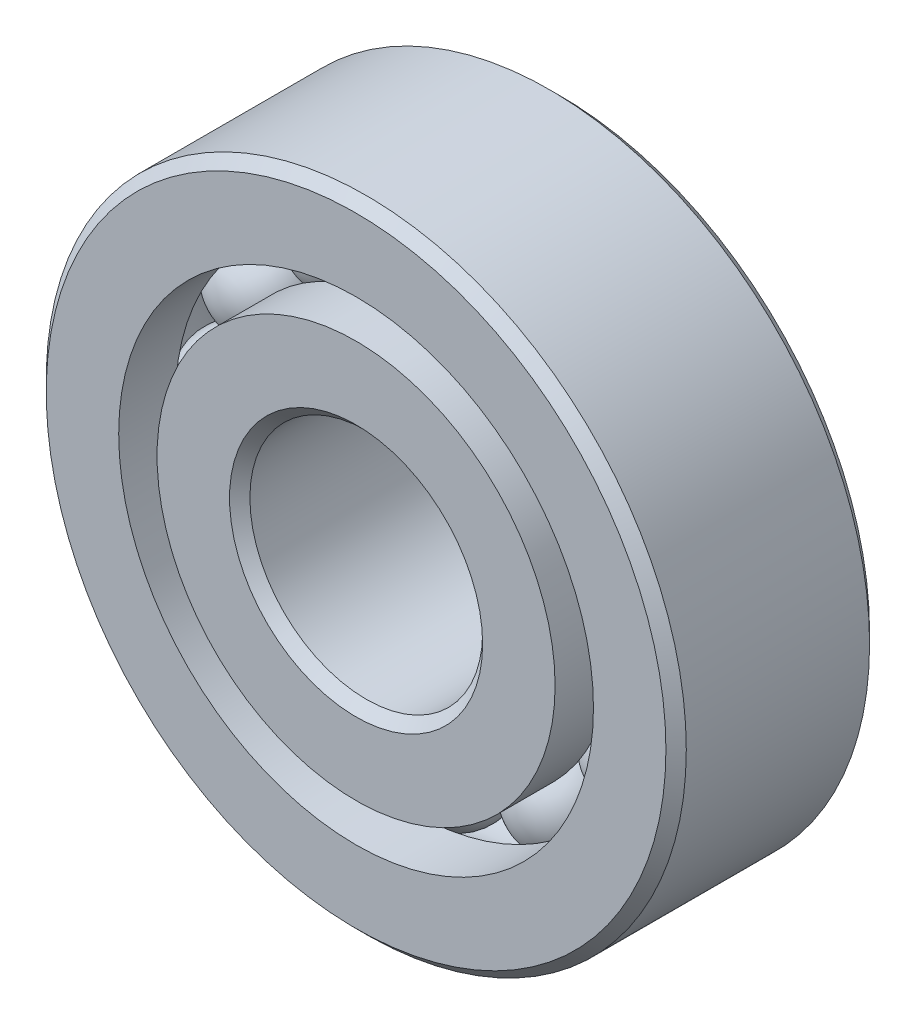
ISO-10303-21;
HEADER;
FILE_DESCRIPTION(('STEP AP214'),'2;1');
FILE_NAME('part.step','',(''),(''),'','','');
FILE_SCHEMA(('AUTOMOTIVE_DESIGN { 1 0 10303 214 1 1 1 1 }'));
ENDSEC;
DATA;
#1=APPLICATION_CONTEXT('core data for automotive mechanical design processes');
#2=APPLICATION_PROTOCOL_DEFINITION('international standard','automotive_design',2000,#1);
#3=PRODUCT_CONTEXT('',#1,'mechanical');
#4=PRODUCT('Part','Part','',(#3));
#5=PRODUCT_RELATED_PRODUCT_CATEGORY('part','',(#4));
#6=PRODUCT_DEFINITION_FORMATION('','',#4);
#7=PRODUCT_DEFINITION_CONTEXT('part definition',#1,'design');
#8=PRODUCT_DEFINITION('design','',#6,#7);
#9=PRODUCT_DEFINITION_SHAPE('','',#8);
#10=(LENGTH_UNIT() NAMED_UNIT(*) SI_UNIT(.MILLI.,.METRE.));
#11=(NAMED_UNIT(*) PLANE_ANGLE_UNIT() SI_UNIT($,.RADIAN.));
#12=(NAMED_UNIT(*) SI_UNIT($,.STERADIAN.) SOLID_ANGLE_UNIT());
#13=UNCERTAINTY_MEASURE_WITH_UNIT(LENGTH_MEASURE(1.E-05),#10,'distance_accuracy_value','');
#14=(GEOMETRIC_REPRESENTATION_CONTEXT(3) GLOBAL_UNCERTAINTY_ASSIGNED_CONTEXT((#13)) GLOBAL_UNIT_ASSIGNED_CONTEXT((#10,
#11,#12)) REPRESENTATION_CONTEXT('',''));
#15=CARTESIAN_POINT('',(0.,0.,0.));
#16=DIRECTION('',(0.,0.,1.));
#17=DIRECTION('',(1.,0.,0.));
#18=AXIS2_PLACEMENT_3D('',#15,#16,#17);
#19=CARTESIAN_POINT('',(-3.74999999999992,6.49519052838334,0.));
#20=DIRECTION('',(0.,0.,1.));
#21=DIRECTION('',(-0.499999999999989,0.866025403784445,0.));
#22=AXIS2_PLACEMENT_3D('',#19,#20,#21);
#23=SPHERICAL_SURFACE('',#22,1.68952158656808);
#24=CARTESIAN_POINT('',(-3.74999999999992,6.49519052838334,1.68952158656808));
#25=VERTEX_POINT('',#24);
#26=VERTEX_LOOP('',#25);
#27=FACE_BOUND('',#26,.T.);
#28=ADVANCED_FACE('F39',(#27),#23,.T.);
#29=CLOSED_SHELL('',(#28));
#30=MANIFOLD_SOLID_BREP('B2',#29);
#31=CARTESIAN_POINT('',(-6.49519052838325,3.75000000000008,0.));
#32=DIRECTION('',(0.,0.,1.));
#33=DIRECTION('',(-0.866025403784433,0.50000000000001,0.));
#34=AXIS2_PLACEMENT_3D('',#31,#32,#33);
#35=SPHERICAL_SURFACE('',#34,1.68952158656808);
#36=CARTESIAN_POINT('',(-6.49519052838325,3.75000000000008,1.68952158656808));
#37=VERTEX_POINT('',#36);
#38=VERTEX_LOOP('',#37);
#39=FACE_BOUND('',#38,.T.);
#40=ADVANCED_FACE('F59',(#39),#35,.T.);
#41=CLOSED_SHELL('',(#40));
#42=MANIFOLD_SOLID_BREP('B6',#41);
#43=CARTESIAN_POINT('',(-7.5,0.,0.));
#44=DIRECTION('',(0.,0.,1.));
#45=DIRECTION('',(-1.,0.,0.));
#46=AXIS2_PLACEMENT_3D('',#43,#44,#45);
#47=SPHERICAL_SURFACE('',#46,1.68952158656808);
#48=CARTESIAN_POINT('',(-7.5,0.,1.68952158656808));
#49=VERTEX_POINT('',#48);
#50=VERTEX_LOOP('',#49);
#51=FACE_BOUND('',#50,.T.);
#52=ADVANCED_FACE('F79',(#51),#47,.T.);
#53=CLOSED_SHELL('',(#52));
#54=MANIFOLD_SOLID_BREP('B35',#53);
#55=CARTESIAN_POINT('',(-6.49519052838332,-3.74999999999994,0.));
#56=DIRECTION('',(0.,0.,1.));
#57=DIRECTION('',(-0.866025403784443,-0.499999999999992,0.));
#58=AXIS2_PLACEMENT_3D('',#55,#56,#57);
#59=SPHERICAL_SURFACE('',#58,1.68952158656808);
#60=CARTESIAN_POINT('',(-6.49519052838332,-3.74999999999994,1.68952158656808));
#61=VERTEX_POINT('',#60);
#62=VERTEX_LOOP('',#61);
#63=FACE_BOUND('',#62,.T.);
#64=ADVANCED_FACE('F99',(#63),#59,.T.);
#65=CLOSED_SHELL('',(#64));
#66=MANIFOLD_SOLID_BREP('B55',#65);
#67=CARTESIAN_POINT('',(-3.75000000000005,-6.49519052838326,0.));
#68=DIRECTION('',(0.,0.,1.));
#69=DIRECTION('',(-0.500000000000007,-0.866025403784435,0.));
#70=AXIS2_PLACEMENT_3D('',#67,#68,#69);
#71=SPHERICAL_SURFACE('',#70,1.68952158656808);
#72=CARTESIAN_POINT('',(-3.75000000000005,-6.49519052838326,1.68952158656808));
#73=VERTEX_POINT('',#72);
#74=VERTEX_LOOP('',#73);
#75=FACE_BOUND('',#74,.T.);
#76=ADVANCED_FACE('F119',(#75),#71,.T.);
#77=CLOSED_SHELL('',(#76));
#78=MANIFOLD_SOLID_BREP('B75',#77);
#79=CARTESIAN_POINT('',(0.,-7.5,0.));
#80=DIRECTION('',(0.,0.,1.));
#81=DIRECTION('',(0.,-1.,0.));
#82=AXIS2_PLACEMENT_3D('',#79,#80,#81);
#83=SPHERICAL_SURFACE('',#82,1.68952158656808);
#84=CARTESIAN_POINT('',(0.,-7.5,1.68952158656808));
#85=VERTEX_POINT('',#84);
#86=VERTEX_LOOP('',#85);
#87=FACE_BOUND('',#86,.T.);
#88=ADVANCED_FACE('F139',(#87),#83,.T.);
#89=CLOSED_SHELL('',(#88));
#90=MANIFOLD_SOLID_BREP('B95',#89);
#91=CARTESIAN_POINT('',(3.74999999999996,-6.49519052838331,0.));
#92=DIRECTION('',(0.,0.,1.));
#93=DIRECTION('',(0.499999999999995,-0.866025403784442,0.));
#94=AXIS2_PLACEMENT_3D('',#91,#92,#93);
#95=SPHERICAL_SURFACE('',#94,1.68952158656808);
#96=CARTESIAN_POINT('',(3.74999999999996,-6.49519052838331,1.68952158656808));
#97=VERTEX_POINT('',#96);
#98=VERTEX_LOOP('',#97);
#99=FACE_BOUND('',#98,.T.);
#100=ADVANCED_FACE('F159',(#99),#95,.T.);
#101=CLOSED_SHELL('',(#100));
#102=MANIFOLD_SOLID_BREP('B115',#101);
#103=CARTESIAN_POINT('',(6.49519052838327,-3.75000000000003,0.));
#104=DIRECTION('',(0.,0.,1.));
#105=DIRECTION('',(0.866025403784436,-0.500000000000004,0.));
#106=AXIS2_PLACEMENT_3D('',#103,#104,#105);
#107=SPHERICAL_SURFACE('',#106,1.68952158656808);
#108=CARTESIAN_POINT('',(6.49519052838327,-3.75000000000003,1.68952158656808));
#109=VERTEX_POINT('',#108);
#110=VERTEX_LOOP('',#109);
#111=FACE_BOUND('',#110,.T.);
#112=ADVANCED_FACE('F179',(#111),#107,.T.);
#113=CLOSED_SHELL('',(#112));
#114=MANIFOLD_SOLID_BREP('B135',#113);
#115=CARTESIAN_POINT('',(7.5,0.,0.));
#116=DIRECTION('',(0.,0.,1.));
#117=DIRECTION('',(1.,0.,0.));
#118=AXIS2_PLACEMENT_3D('',#115,#116,#117);
#119=SPHERICAL_SURFACE('',#118,1.68952158656808);
#120=CARTESIAN_POINT('',(7.5,0.,1.68952158656808));
#121=VERTEX_POINT('',#120);
#122=VERTEX_LOOP('',#121);
#123=FACE_BOUND('',#122,.T.);
#124=ADVANCED_FACE('F199',(#123),#119,.T.);
#125=CLOSED_SHELL('',(#124));
#126=MANIFOLD_SOLID_BREP('B155',#125);
#127=CARTESIAN_POINT('',(6.4951905283833,3.74999999999998,0.));
#128=DIRECTION('',(0.,0.,1.));
#129=DIRECTION('',(0.86602540378444,0.499999999999998,0.));
#130=AXIS2_PLACEMENT_3D('',#127,#128,#129);
#131=SPHERICAL_SURFACE('',#130,1.68952158656808);
#132=CARTESIAN_POINT('',(6.4951905283833,3.74999999999998,1.68952158656808));
#133=VERTEX_POINT('',#132);
#134=VERTEX_LOOP('',#133);
#135=FACE_BOUND('',#134,.T.);
#136=ADVANCED_FACE('F219',(#135),#131,.T.);
#137=CLOSED_SHELL('',(#136));
#138=MANIFOLD_SOLID_BREP('B175',#137);
#139=CARTESIAN_POINT('',(3.75000000000001,6.49519052838328,0.));
#140=DIRECTION('',(0.,0.,1.));
#141=DIRECTION('',(0.500000000000001,0.866025403784438,0.));
#142=AXIS2_PLACEMENT_3D('',#139,#140,#141);
#143=SPHERICAL_SURFACE('',#142,1.68952158656808);
#144=CARTESIAN_POINT('',(3.75000000000001,6.49519052838328,1.68952158656808));
#145=VERTEX_POINT('',#144);
#146=VERTEX_LOOP('',#145);
#147=FACE_BOUND('',#146,.T.);
#148=ADVANCED_FACE('F239',(#147),#143,.T.);
#149=CLOSED_SHELL('',(#148));
#150=MANIFOLD_SOLID_BREP('B195',#149);
#151=CARTESIAN_POINT('',(0.,7.5,0.));
#152=DIRECTION('',(0.,0.,1.));
#153=DIRECTION('',(0.,1.,0.));
#154=AXIS2_PLACEMENT_3D('',#151,#152,#153);
#155=SPHERICAL_SURFACE('',#154,1.68952158656808);
#156=CARTESIAN_POINT('',(0.,7.5,1.68952158656808));
#157=VERTEX_POINT('',#156);
#158=VERTEX_LOOP('',#157);
#159=FACE_BOUND('',#158,.T.);
#160=ADVANCED_FACE('F261',(#159),#155,.T.);
#161=CLOSED_SHELL('',(#160));
#162=MANIFOLD_SOLID_BREP('B215',#161);
#163=CARTESIAN_POINT('',(0.,6.84065934065934,3.5));
#164=DIRECTION('',(0.,0.,-1.));
#165=DIRECTION('',(-1.,0.,0.));
#166=AXIS2_PLACEMENT_3D('',#163,#164,#165);
#167=PLANE('',#166);
#168=CARTESIAN_POINT('',(0.,0.,3.5));
#169=DIRECTION('',(0.,0.,1.));
#170=DIRECTION('',(1.,0.,0.));
#171=AXIS2_PLACEMENT_3D('',#168,#169,#170);
#172=CIRCLE('',#171,4.35);
#173=CARTESIAN_POINT('',(4.35,0.,3.5));
#174=VERTEX_POINT('',#173);
#175=EDGE_CURVE('E308',#174,#174,#172,.T.);
#176=ORIENTED_EDGE('',*,*,#175,.F.);
#177=EDGE_LOOP('',(#176));
#178=FACE_BOUND('',#177,.T.);
#179=CARTESIAN_POINT('',(0.,0.,3.5));
#180=DIRECTION('',(0.,0.,1.));
#181=DIRECTION('',(1.,0.,0.));
#182=AXIS2_PLACEMENT_3D('',#179,#180,#181);
#183=CIRCLE('',#182,6.84065934065934);
#184=CARTESIAN_POINT('',(6.84065934065934,0.,3.5));
#185=VERTEX_POINT('',#184);
#186=EDGE_CURVE('E260',#185,#185,#183,.T.);
#187=ORIENTED_EDGE('',*,*,#186,.T.);
#188=EDGE_LOOP('',(#187));
#189=FACE_BOUND('',#188,.T.);
#190=ADVANCED_FACE('F280',(#178,#189),#167,.F.);
#191=CARTESIAN_POINT('',(0.,0.,3.5));
#192=DIRECTION('',(0.,0.,1.));
#193=DIRECTION('',(1.,0.,0.));
#194=AXIS2_PLACEMENT_3D('',#191,#192,#193);
#195=CYLINDRICAL_SURFACE('',#194,6.84065934065934);
#196=ORIENTED_EDGE('',*,*,#186,.F.);
#197=EDGE_LOOP('',(#196));
#198=FACE_BOUND('',#197,.T.);
#199=CARTESIAN_POINT('',(0.,0.,1.55555555555556));
#200=DIRECTION('',(0.,0.,1.));
#201=DIRECTION('',(1.,0.,0.));
#202=AXIS2_PLACEMENT_3D('',#199,#200,#201);
#203=CIRCLE('',#202,6.84065934065934);
#204=CARTESIAN_POINT('',(6.84065934065934,0.,1.55555555555556));
#205=VERTEX_POINT('',#204);
#206=EDGE_CURVE('E286',#205,#205,#203,.T.);
#207=ORIENTED_EDGE('',*,*,#206,.T.);
#208=EDGE_LOOP('',(#207));
#209=FACE_BOUND('',#208,.T.);
#210=ADVANCED_FACE('F315',(#198,#209),#195,.T.);
#211=CARTESIAN_POINT('',(0.,0.,0.));
#212=DIRECTION('',(0.,0.,1.));
#213=DIRECTION('',(1.,0.,0.));
#214=AXIS2_PLACEMENT_3D('',#211,#212,#213);
#215=TOROIDAL_SURFACE('',#214,7.5,1.68952158656808);
#216=ORIENTED_EDGE('',*,*,#206,.F.);
#217=EDGE_LOOP('',(#216));
#218=FACE_BOUND('',#217,.T.);
#219=CARTESIAN_POINT('',(0.,0.,-1.55555555555556));
#220=DIRECTION('',(0.,0.,1.));
#221=DIRECTION('',(1.,0.,0.));
#222=AXIS2_PLACEMENT_3D('',#219,#220,#221);
#223=CIRCLE('',#222,6.84065934065934);
#224=CARTESIAN_POINT('',(6.84065934065934,0.,-1.55555555555556));
#225=VERTEX_POINT('',#224);
#226=EDGE_CURVE('E290',#225,#225,#223,.T.);
#227=ORIENTED_EDGE('',*,*,#226,.T.);
#228=EDGE_LOOP('',(#227));
#229=FACE_BOUND('',#228,.T.);
#230=ADVANCED_FACE('F319',(#218,#229),#215,.F.);
#231=CARTESIAN_POINT('',(0.,0.,3.5));
#232=DIRECTION('',(0.,0.,1.));
#233=DIRECTION('',(1.,0.,0.));
#234=AXIS2_PLACEMENT_3D('',#231,#232,#233);
#235=CYLINDRICAL_SURFACE('',#234,6.84065934065934);
#236=ORIENTED_EDGE('',*,*,#226,.F.);
#237=EDGE_LOOP('',(#236));
#238=FACE_BOUND('',#237,.T.);
#239=CARTESIAN_POINT('',(0.,0.,-3.5));
#240=DIRECTION('',(0.,0.,1.));
#241=DIRECTION('',(1.,0.,0.));
#242=AXIS2_PLACEMENT_3D('',#239,#240,#241);
#243=CIRCLE('',#242,6.84065934065934);
#244=CARTESIAN_POINT('',(6.84065934065934,0.,-3.5));
#245=VERTEX_POINT('',#244);
#246=EDGE_CURVE('E294',#245,#245,#243,.T.);
#247=ORIENTED_EDGE('',*,*,#246,.T.);
#248=EDGE_LOOP('',(#247));
#249=FACE_BOUND('',#248,.T.);
#250=ADVANCED_FACE('F324',(#238,#249),#235,.T.);
#251=CARTESIAN_POINT('',(0.,4.35,-3.5));
#252=DIRECTION('',(0.,0.,1.));
#253=DIRECTION('',(1.,0.,0.));
#254=AXIS2_PLACEMENT_3D('',#251,#252,#253);
#255=PLANE('',#254);
#256=ORIENTED_EDGE('',*,*,#246,.F.);
#257=EDGE_LOOP('',(#256));
#258=FACE_BOUND('',#257,.T.);
#259=CARTESIAN_POINT('',(0.,0.,-3.5));
#260=DIRECTION('',(0.,0.,1.));
#261=DIRECTION('',(1.,0.,0.));
#262=AXIS2_PLACEMENT_3D('',#259,#260,#261);
#263=CIRCLE('',#262,4.35);
#264=CARTESIAN_POINT('',(4.35,0.,-3.5));
#265=VERTEX_POINT('',#264);
#266=EDGE_CURVE('E299',#265,#265,#263,.T.);
#267=ORIENTED_EDGE('',*,*,#266,.T.);
#268=EDGE_LOOP('',(#267));
#269=FACE_BOUND('',#268,.T.);
#270=ADVANCED_FACE('F330',(#258,#269),#255,.F.);
#271=CARTESIAN_POINT('',(0.,0.,-3.15));
#272=DIRECTION('',(0.,0.,-1.));
#273=DIRECTION('',(-1.,0.,0.));
#274=AXIS2_PLACEMENT_3D('',#271,#272,#273);
#275=CONICAL_SURFACE('',#274,4.,0.785398163397446);
#276=ORIENTED_EDGE('',*,*,#266,.F.);
#277=EDGE_LOOP('',(#276));
#278=FACE_BOUND('',#277,.T.);
#279=CARTESIAN_POINT('',(0.,0.,-3.15));
#280=DIRECTION('',(0.,0.,1.));
#281=DIRECTION('',(1.,0.,0.));
#282=AXIS2_PLACEMENT_3D('',#279,#280,#281);
#283=CIRCLE('',#282,4.);
#284=CARTESIAN_POINT('',(4.,0.,-3.15));
#285=VERTEX_POINT('',#284);
#286=EDGE_CURVE('E302',#285,#285,#283,.T.);
#287=ORIENTED_EDGE('',*,*,#286,.T.);
#288=EDGE_LOOP('',(#287));
#289=FACE_BOUND('',#288,.T.);
#290=ADVANCED_FACE('F334',(#278,#289),#275,.F.);
#291=CARTESIAN_POINT('',(0.,0.,3.5));
#292=DIRECTION('',(0.,0.,1.));
#293=DIRECTION('',(1.,0.,0.));
#294=AXIS2_PLACEMENT_3D('',#291,#292,#293);
#295=CYLINDRICAL_SURFACE('',#294,4.);
#296=ORIENTED_EDGE('',*,*,#286,.F.);
#297=EDGE_LOOP('',(#296));
#298=FACE_BOUND('',#297,.T.);
#299=CARTESIAN_POINT('',(0.,0.,3.15));
#300=DIRECTION('',(0.,0.,1.));
#301=DIRECTION('',(1.,0.,0.));
#302=AXIS2_PLACEMENT_3D('',#299,#300,#301);
#303=CIRCLE('',#302,4.);
#304=CARTESIAN_POINT('',(4.,0.,3.15));
#305=VERTEX_POINT('',#304);
#306=EDGE_CURVE('E305',#305,#305,#303,.T.);
#307=ORIENTED_EDGE('',*,*,#306,.T.);
#308=EDGE_LOOP('',(#307));
#309=FACE_BOUND('',#308,.T.);
#310=ADVANCED_FACE('F338',(#298,#309),#295,.F.);
#311=CARTESIAN_POINT('',(0.,0.,3.5));
#312=DIRECTION('',(0.,0.,1.));
#313=DIRECTION('',(1.,0.,0.));
#314=AXIS2_PLACEMENT_3D('',#311,#312,#313);
#315=CONICAL_SURFACE('',#314,4.35,0.785398163397449);
#316=ORIENTED_EDGE('',*,*,#306,.F.);
#317=EDGE_LOOP('',(#316));
#318=FACE_BOUND('',#317,.T.);
#319=ORIENTED_EDGE('',*,*,#175,.T.);
#320=EDGE_LOOP('',(#319));
#321=FACE_BOUND('',#320,.T.);
#322=ADVANCED_FACE('F312',(#318,#321),#315,.F.);
#323=CLOSED_SHELL('',(#190,#210,#230,#250,#270,#290,#310,#322));
#324=MANIFOLD_SOLID_BREP('B235',#323);
#325=CARTESIAN_POINT('',(0.,0.,3.15));
#326=DIRECTION('',(0.,0.,-1.));
#327=DIRECTION('',(-1.,0.,0.));
#328=AXIS2_PLACEMENT_3D('',#325,#326,#327);
#329=CONICAL_SURFACE('',#328,11.,0.785398163397448);
#330=CARTESIAN_POINT('',(0.,0.,3.5));
#331=DIRECTION('',(0.,0.,1.));
#332=DIRECTION('',(1.,0.,0.));
#333=AXIS2_PLACEMENT_3D('',#330,#331,#332);
#334=CIRCLE('',#333,10.65);
#335=CARTESIAN_POINT('',(10.65,0.,3.5));
#336=VERTEX_POINT('',#335);
#337=EDGE_CURVE('E429',#336,#336,#334,.T.);
#338=ORIENTED_EDGE('',*,*,#337,.F.);
#339=EDGE_LOOP('',(#338));
#340=FACE_BOUND('',#339,.T.);
#341=CARTESIAN_POINT('',(0.,0.,3.15));
#342=DIRECTION('',(0.,0.,1.));
#343=DIRECTION('',(1.,0.,0.));
#344=AXIS2_PLACEMENT_3D('',#341,#342,#343);
#345=CIRCLE('',#344,11.);
#346=CARTESIAN_POINT('',(11.,0.,3.15));
#347=VERTEX_POINT('',#346);
#348=EDGE_CURVE('E279',#347,#347,#345,.T.);
#349=ORIENTED_EDGE('',*,*,#348,.T.);
#350=EDGE_LOOP('',(#349));
#351=FACE_BOUND('',#350,.T.);
#352=ADVANCED_FACE('F401',(#340,#351),#329,.T.);
#353=CARTESIAN_POINT('',(0.,0.,3.5));
#354=DIRECTION('',(0.,0.,1.));
#355=DIRECTION('',(1.,0.,0.));
#356=AXIS2_PLACEMENT_3D('',#353,#354,#355);
#357=CYLINDRICAL_SURFACE('',#356,11.);
#358=ORIENTED_EDGE('',*,*,#348,.F.);
#359=EDGE_LOOP('',(#358));
#360=FACE_BOUND('',#359,.T.);
#361=CARTESIAN_POINT('',(0.,0.,-3.15));
#362=DIRECTION('',(0.,0.,1.));
#363=DIRECTION('',(1.,0.,0.));
#364=AXIS2_PLACEMENT_3D('',#361,#362,#363);
#365=CIRCLE('',#364,11.);
#366=CARTESIAN_POINT('',(11.,0.,-3.15));
#367=VERTEX_POINT('',#366);
#368=EDGE_CURVE('E407',#367,#367,#365,.T.);
#369=ORIENTED_EDGE('',*,*,#368,.T.);
#370=EDGE_LOOP('',(#369));
#371=FACE_BOUND('',#370,.T.);
#372=ADVANCED_FACE('F436',(#360,#371),#357,.T.);
#373=CARTESIAN_POINT('',(0.,0.,-3.5));
#374=DIRECTION('',(0.,0.,1.));
#375=DIRECTION('',(1.,0.,0.));
#376=AXIS2_PLACEMENT_3D('',#373,#374,#375);
#377=CONICAL_SURFACE('',#376,10.65,0.785398163397447);
#378=ORIENTED_EDGE('',*,*,#368,.F.);
#379=EDGE_LOOP('',(#378));
#380=FACE_BOUND('',#379,.T.);
#381=CARTESIAN_POINT('',(0.,0.,-3.5));
#382=DIRECTION('',(0.,0.,1.));
#383=DIRECTION('',(1.,0.,0.));
#384=AXIS2_PLACEMENT_3D('',#381,#382,#383);
#385=CIRCLE('',#384,10.65);
#386=CARTESIAN_POINT('',(10.65,0.,-3.5));
#387=VERTEX_POINT('',#386);
#388=EDGE_CURVE('E411',#387,#387,#385,.T.);
#389=ORIENTED_EDGE('',*,*,#388,.T.);
#390=EDGE_LOOP('',(#389));
#391=FACE_BOUND('',#390,.T.);
#392=ADVANCED_FACE('F440',(#380,#391),#377,.T.);
#393=CARTESIAN_POINT('',(0.,10.65,-3.5));
#394=DIRECTION('',(0.,0.,1.));
#395=DIRECTION('',(1.,0.,0.));
#396=AXIS2_PLACEMENT_3D('',#393,#394,#395);
#397=PLANE('',#396);
#398=ORIENTED_EDGE('',*,*,#388,.F.);
#399=EDGE_LOOP('',(#398));
#400=FACE_BOUND('',#399,.T.);
#401=CARTESIAN_POINT('',(0.,0.,-3.5));
#402=DIRECTION('',(0.,0.,1.));
#403=DIRECTION('',(1.,0.,0.));
#404=AXIS2_PLACEMENT_3D('',#401,#402,#403);
#405=CIRCLE('',#404,8.15934065934066);
#406=CARTESIAN_POINT('',(8.15934065934066,0.,-3.5));
#407=VERTEX_POINT('',#406);
#408=EDGE_CURVE('E415',#407,#407,#405,.T.);
#409=ORIENTED_EDGE('',*,*,#408,.T.);
#410=EDGE_LOOP('',(#409));
#411=FACE_BOUND('',#410,.T.);
#412=ADVANCED_FACE('F445',(#400,#411),#397,.F.);
#413=CARTESIAN_POINT('',(0.,0.,3.5));
#414=DIRECTION('',(0.,0.,1.));
#415=DIRECTION('',(1.,0.,0.));
#416=AXIS2_PLACEMENT_3D('',#413,#414,#415);
#417=CYLINDRICAL_SURFACE('',#416,8.15934065934066);
#418=ORIENTED_EDGE('',*,*,#408,.F.);
#419=EDGE_LOOP('',(#418));
#420=FACE_BOUND('',#419,.T.);
#421=CARTESIAN_POINT('',(0.,0.,-1.55555555555556));
#422=DIRECTION('',(0.,0.,1.));
#423=DIRECTION('',(1.,0.,0.));
#424=AXIS2_PLACEMENT_3D('',#421,#422,#423);
#425=CIRCLE('',#424,8.15934065934066);
#426=CARTESIAN_POINT('',(8.15934065934066,0.,-1.55555555555556));
#427=VERTEX_POINT('',#426);
#428=EDGE_CURVE('E420',#427,#427,#425,.T.);
#429=ORIENTED_EDGE('',*,*,#428,.T.);
#430=EDGE_LOOP('',(#429));
#431=FACE_BOUND('',#430,.T.);
#432=ADVANCED_FACE('F451',(#420,#431),#417,.F.);
#433=CARTESIAN_POINT('',(0.,0.,0.));
#434=DIRECTION('',(0.,0.,1.));
#435=DIRECTION('',(1.,0.,0.));
#436=AXIS2_PLACEMENT_3D('',#433,#434,#435);
#437=TOROIDAL_SURFACE('',#436,7.5,1.68952158656808);
#438=ORIENTED_EDGE('',*,*,#428,.F.);
#439=EDGE_LOOP('',(#438));
#440=FACE_BOUND('',#439,.T.);
#441=CARTESIAN_POINT('',(0.,0.,1.55555555555555));
#442=DIRECTION('',(0.,0.,1.));
#443=DIRECTION('',(1.,0.,0.));
#444=AXIS2_PLACEMENT_3D('',#441,#442,#443);
#445=CIRCLE('',#444,8.15934065934066);
#446=CARTESIAN_POINT('',(8.15934065934066,0.,1.55555555555555));
#447=VERTEX_POINT('',#446);
#448=EDGE_CURVE('E423',#447,#447,#445,.T.);
#449=ORIENTED_EDGE('',*,*,#448,.T.);
#450=EDGE_LOOP('',(#449));
#451=FACE_BOUND('',#450,.T.);
#452=ADVANCED_FACE('F455',(#440,#451),#437,.F.);
#453=CARTESIAN_POINT('',(0.,0.,3.5));
#454=DIRECTION('',(0.,0.,1.));
#455=DIRECTION('',(1.,0.,0.));
#456=AXIS2_PLACEMENT_3D('',#453,#454,#455);
#457=CYLINDRICAL_SURFACE('',#456,8.15934065934066);
#458=ORIENTED_EDGE('',*,*,#448,.F.);
#459=EDGE_LOOP('',(#458));
#460=FACE_BOUND('',#459,.T.);
#461=CARTESIAN_POINT('',(0.,0.,3.5));
#462=DIRECTION('',(0.,0.,1.));
#463=DIRECTION('',(1.,0.,0.));
#464=AXIS2_PLACEMENT_3D('',#461,#462,#463);
#465=CIRCLE('',#464,8.15934065934066);
#466=CARTESIAN_POINT('',(8.15934065934066,0.,3.5));
#467=VERTEX_POINT('',#466);
#468=EDGE_CURVE('E426',#467,#467,#465,.T.);
#469=ORIENTED_EDGE('',*,*,#468,.T.);
#470=EDGE_LOOP('',(#469));
#471=FACE_BOUND('',#470,.T.);
#472=ADVANCED_FACE('F459',(#460,#471),#457,.F.);
#473=CARTESIAN_POINT('',(0.,10.65,3.5));
#474=DIRECTION('',(0.,0.,-1.));
#475=DIRECTION('',(-1.,0.,0.));
#476=AXIS2_PLACEMENT_3D('',#473,#474,#475);
#477=PLANE('',#476);
#478=ORIENTED_EDGE('',*,*,#468,.F.);
#479=EDGE_LOOP('',(#478));
#480=FACE_BOUND('',#479,.T.);
#481=ORIENTED_EDGE('',*,*,#337,.T.);
#482=EDGE_LOOP('',(#481));
#483=FACE_BOUND('',#482,.T.);
#484=ADVANCED_FACE('F433',(#480,#483),#477,.F.);
#485=CLOSED_SHELL('',(#352,#372,#392,#412,#432,#452,#472,#484));
#486=MANIFOLD_SOLID_BREP('B255',#485);
#487=ADVANCED_BREP_SHAPE_REPRESENTATION('',(#18,#30,#42,#54,#66,#78,#90,#102,#114,#126,#138,
#150,#162,#324,#486),#14);
#488=SHAPE_DEFINITION_REPRESENTATION(#9,#487);
ENDSEC;
END-ISO-10303-21;
